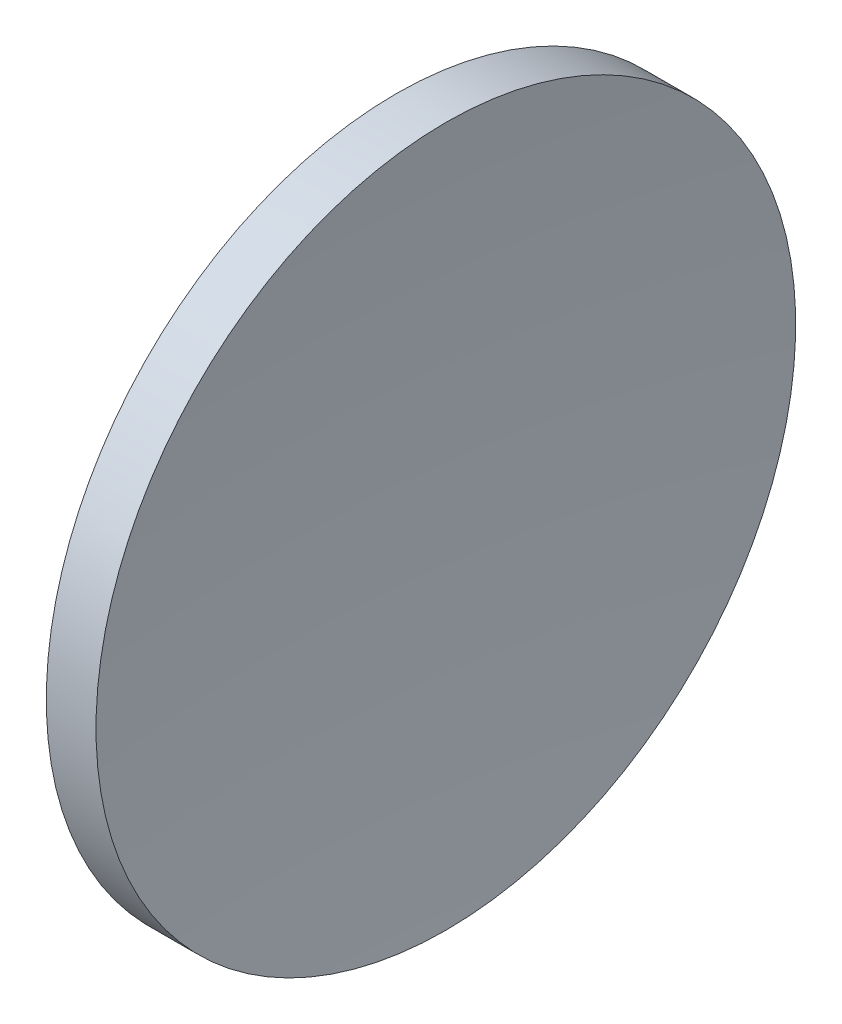
ISO-10303-21;
HEADER;
FILE_DESCRIPTION(('STEP AP214'),'2;1');
FILE_NAME('part.step','',(''),(''),'','','');
FILE_SCHEMA(('AUTOMOTIVE_DESIGN { 1 0 10303 214 1 1 1 1 }'));
ENDSEC;
DATA;
#1=APPLICATION_CONTEXT('core data for automotive mechanical design processes');
#2=APPLICATION_PROTOCOL_DEFINITION('international standard','automotive_design',2000,#1);
#3=PRODUCT_CONTEXT('',#1,'mechanical');
#4=PRODUCT('Part','Part','',(#3));
#5=PRODUCT_RELATED_PRODUCT_CATEGORY('part','',(#4));
#6=PRODUCT_DEFINITION_FORMATION('','',#4);
#7=PRODUCT_DEFINITION_CONTEXT('part definition',#1,'design');
#8=PRODUCT_DEFINITION('design','',#6,#7);
#9=PRODUCT_DEFINITION_SHAPE('','',#8);
#10=(LENGTH_UNIT() NAMED_UNIT(*) SI_UNIT(.MILLI.,.METRE.));
#11=(NAMED_UNIT(*) PLANE_ANGLE_UNIT() SI_UNIT($,.RADIAN.));
#12=(NAMED_UNIT(*) SI_UNIT($,.STERADIAN.) SOLID_ANGLE_UNIT());
#13=UNCERTAINTY_MEASURE_WITH_UNIT(LENGTH_MEASURE(1.E-05),#10,'distance_accuracy_value','');
#14=(GEOMETRIC_REPRESENTATION_CONTEXT(3) GLOBAL_UNCERTAINTY_ASSIGNED_CONTEXT((#13)) GLOBAL_UNIT_ASSIGNED_CONTEXT((#10,
#11,#12)) REPRESENTATION_CONTEXT('',''));
#15=CARTESIAN_POINT('',(0.,0.,0.));
#16=DIRECTION('',(0.,0.,1.));
#17=DIRECTION('',(1.,0.,0.));
#18=AXIS2_PLACEMENT_3D('',#15,#16,#17);
#19=CARTESIAN_POINT('',(334.48213112149,130.433680941881,0.));
#20=DIRECTION('',(-1.,0.,0.));
#21=DIRECTION('',(0.,1.,0.));
#22=AXIS2_PLACEMENT_3D('',#19,#20,#21);
#23=SPHERICAL_SURFACE('',#22,89.2);
#24=CARTESIAN_POINT('',(248.857134771125,130.433680941881,0.));
#25=DIRECTION('',(-1.,0.,0.));
#26=DIRECTION('',(0.,-1.,0.));
#27=AXIS2_PLACEMENT_3D('',#24,#25,#26);
#28=CIRCLE('',#27,25.);
#29=CARTESIAN_POINT('',(248.857134771125,105.433680941881,0.));
#30=VERTEX_POINT('',#29);
#31=EDGE_CURVE('E41',#30,#30,#28,.T.);
#32=ORIENTED_EDGE('',*,*,#31,.T.);
#33=EDGE_LOOP('',(#32));
#34=FACE_BOUND('',#33,.T.);
#35=ADVANCED_FACE('F35',(#34),#23,.T.);
#36=CARTESIAN_POINT('',(487.08213112149,130.433680941881,0.));
#37=DIRECTION('',(-1.,0.,0.));
#38=DIRECTION('',(0.,1.,0.));
#39=AXIS2_PLACEMENT_3D('',#36,#37,#38);
#40=SPHERICAL_SURFACE('',#39,236.);
#41=CARTESIAN_POINT('',(252.410019442237,130.433680941881,0.));
#42=DIRECTION('',(-1.,0.,0.));
#43=DIRECTION('',(0.,-1.,0.));
#44=AXIS2_PLACEMENT_3D('',#41,#42,#43);
#45=CIRCLE('',#44,24.9999999999999);
#46=CARTESIAN_POINT('',(252.410019442237,105.433680941881,0.));
#47=VERTEX_POINT('',#46);
#48=EDGE_CURVE('E10',#47,#47,#45,.T.);
#49=ORIENTED_EDGE('',*,*,#48,.F.);
#50=EDGE_LOOP('',(#49));
#51=FACE_BOUND('',#50,.T.);
#52=ADVANCED_FACE('F50',(#51),#40,.F.);
#53=CARTESIAN_POINT('',(231.888982595926,130.433680941881,0.));
#54=DIRECTION('',(-1.,0.,0.));
#55=DIRECTION('',(0.,-1.,0.));
#56=AXIS2_PLACEMENT_3D('',#53,#54,#55);
#57=CYLINDRICAL_SURFACE('',#56,25.);
#58=ORIENTED_EDGE('',*,*,#31,.F.);
#59=EDGE_LOOP('',(#58));
#60=FACE_BOUND('',#59,.T.);
#61=ORIENTED_EDGE('',*,*,#48,.T.);
#62=EDGE_LOOP('',(#61));
#63=FACE_BOUND('',#62,.T.);
#64=ADVANCED_FACE('F48',(#60,#63),#57,.T.);
#65=CLOSED_SHELL('',(#35,#52,#64));
#66=MANIFOLD_SOLID_BREP('B2',#65);
#67=ADVANCED_BREP_SHAPE_REPRESENTATION('',(#18,#66),#14);
#68=SHAPE_DEFINITION_REPRESENTATION(#9,#67);
ENDSEC;
END-ISO-10303-21;
